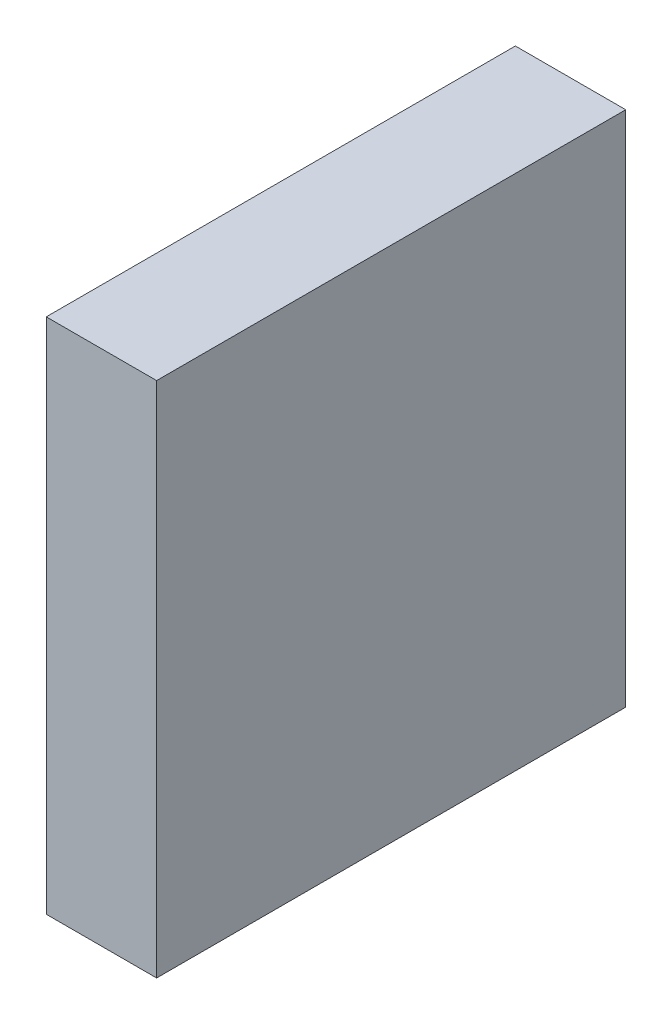
ISO-10303-21;
HEADER;
FILE_DESCRIPTION(('STEP AP214'),'2;1');
FILE_NAME('part.step','',(''),(''),'','','');
FILE_SCHEMA(('AUTOMOTIVE_DESIGN { 1 0 10303 214 1 1 1 1 }'));
ENDSEC;
DATA;
#1=APPLICATION_CONTEXT('core data for automotive mechanical design processes');
#2=APPLICATION_PROTOCOL_DEFINITION('international standard','automotive_design',2000,#1);
#3=PRODUCT_CONTEXT('',#1,'mechanical');
#4=PRODUCT('Part','Part','',(#3));
#5=PRODUCT_RELATED_PRODUCT_CATEGORY('part','',(#4));
#6=PRODUCT_DEFINITION_FORMATION('','',#4);
#7=PRODUCT_DEFINITION_CONTEXT('part definition',#1,'design');
#8=PRODUCT_DEFINITION('design','',#6,#7);
#9=PRODUCT_DEFINITION_SHAPE('','',#8);
#10=(LENGTH_UNIT() NAMED_UNIT(*) SI_UNIT(.MILLI.,.METRE.));
#11=(NAMED_UNIT(*) PLANE_ANGLE_UNIT() SI_UNIT($,.RADIAN.));
#12=(NAMED_UNIT(*) SI_UNIT($,.STERADIAN.) SOLID_ANGLE_UNIT());
#13=UNCERTAINTY_MEASURE_WITH_UNIT(LENGTH_MEASURE(1.E-05),#10,'distance_accuracy_value','');
#14=(GEOMETRIC_REPRESENTATION_CONTEXT(3) GLOBAL_UNCERTAINTY_ASSIGNED_CONTEXT((#13)) GLOBAL_UNIT_ASSIGNED_CONTEXT((#10,
#11,#12)) REPRESENTATION_CONTEXT('',''));
#15=CARTESIAN_POINT('',(0.,0.,0.));
#16=DIRECTION('',(0.,0.,1.));
#17=DIRECTION('',(1.,0.,0.));
#18=AXIS2_PLACEMENT_3D('',#15,#16,#17);
#19=CARTESIAN_POINT('',(7.99999999999999,37.5,68.));
#20=DIRECTION('',(-1.,0.,0.));
#21=DIRECTION('',(0.,-1.,0.));
#22=AXIS2_PLACEMENT_3D('',#19,#20,#21);
#23=PLANE('',#22);
#24=DIRECTION('',(0.,1.,0.));
#25=VECTOR('',#24,1.);
#26=CARTESIAN_POINT('',(7.99999999999999,37.5,0.));
#27=LINE('',#26,#25);
#28=CARTESIAN_POINT('',(8.,-37.5,0.));
#29=VERTEX_POINT('',#28);
#30=CARTESIAN_POINT('',(7.99999999999999,37.5,0.));
#31=VERTEX_POINT('',#30);
#32=EDGE_CURVE('E97',#29,#31,#27,.T.);
#33=ORIENTED_EDGE('',*,*,#32,.T.);
#34=DIRECTION('',(0.,0.,-1.));
#35=VECTOR('',#34,1.);
#36=CARTESIAN_POINT('',(7.99999999999999,37.5,68.));
#37=LINE('',#36,#35);
#38=CARTESIAN_POINT('',(7.99999999999999,37.5,68.));
#39=VERTEX_POINT('',#38);
#40=EDGE_CURVE('E11',#39,#31,#37,.T.);
#41=ORIENTED_EDGE('',*,*,#40,.F.);
#42=DIRECTION('',(0.,1.,0.));
#43=VECTOR('',#42,1.);
#44=CARTESIAN_POINT('',(7.99999999999999,37.5,68.));
#45=LINE('',#44,#43);
#46=CARTESIAN_POINT('',(8.,-37.5,68.));
#47=VERTEX_POINT('',#46);
#48=EDGE_CURVE('E85',#47,#39,#45,.T.);
#49=ORIENTED_EDGE('',*,*,#48,.F.);
#50=DIRECTION('',(0.,0.,-1.));
#51=VECTOR('',#50,1.);
#52=CARTESIAN_POINT('',(8.,-37.5,68.));
#53=LINE('',#52,#51);
#54=EDGE_CURVE('E93',#47,#29,#53,.T.);
#55=ORIENTED_EDGE('',*,*,#54,.T.);
#56=EDGE_LOOP('',(#33,#41,#49,#55));
#57=FACE_BOUND('',#56,.T.);
#58=ADVANCED_FACE('F34',(#57),#23,.F.);
#59=CARTESIAN_POINT('',(-8.00000000000001,37.5,68.));
#60=DIRECTION('',(0.,-1.,0.));
#61=DIRECTION('',(0.,0.,-1.));
#62=AXIS2_PLACEMENT_3D('',#59,#60,#61);
#63=PLANE('',#62);
#64=DIRECTION('',(-1.,0.,0.));
#65=VECTOR('',#64,1.);
#66=CARTESIAN_POINT('',(-8.00000000000001,37.5,0.));
#67=LINE('',#66,#65);
#68=CARTESIAN_POINT('',(-8.00000000000001,37.5,0.));
#69=VERTEX_POINT('',#68);
#70=EDGE_CURVE('E89',#31,#69,#67,.T.);
#71=ORIENTED_EDGE('',*,*,#70,.T.);
#72=DIRECTION('',(0.,0.,-1.));
#73=VECTOR('',#72,1.);
#74=CARTESIAN_POINT('',(-8.00000000000001,37.5,68.));
#75=LINE('',#74,#73);
#76=CARTESIAN_POINT('',(-8.00000000000001,37.5,68.));
#77=VERTEX_POINT('',#76);
#78=EDGE_CURVE('E42',#77,#69,#75,.T.);
#79=ORIENTED_EDGE('',*,*,#78,.F.);
#80=DIRECTION('',(-1.,0.,0.));
#81=VECTOR('',#80,1.);
#82=CARTESIAN_POINT('',(-8.00000000000001,37.5,68.));
#83=LINE('',#82,#81);
#84=EDGE_CURVE('E80',#39,#77,#83,.T.);
#85=ORIENTED_EDGE('',*,*,#84,.F.);
#86=ORIENTED_EDGE('',*,*,#40,.T.);
#87=EDGE_LOOP('',(#71,#79,#85,#86));
#88=FACE_BOUND('',#87,.T.);
#89=ADVANCED_FACE('F88',(#88),#63,.F.);
#90=CARTESIAN_POINT('',(-8.00000000000001,37.5,68.));
#91=DIRECTION('',(1.,0.,0.));
#92=DIRECTION('',(0.,1.,0.));
#93=AXIS2_PLACEMENT_3D('',#90,#91,#92);
#94=PLANE('',#93);
#95=DIRECTION('',(0.,-1.,0.));
#96=VECTOR('',#95,1.);
#97=CARTESIAN_POINT('',(-8.00000000000001,37.5,0.));
#98=LINE('',#97,#96);
#99=CARTESIAN_POINT('',(-8.,-37.5,0.));
#100=VERTEX_POINT('',#99);
#101=EDGE_CURVE('E67',#69,#100,#98,.T.);
#102=ORIENTED_EDGE('',*,*,#101,.T.);
#103=DIRECTION('',(0.,0.,-1.));
#104=VECTOR('',#103,1.);
#105=CARTESIAN_POINT('',(-8.,-37.5,68.));
#106=LINE('',#105,#104);
#107=CARTESIAN_POINT('',(-8.,-37.5,68.));
#108=VERTEX_POINT('',#107);
#109=EDGE_CURVE('E90',#108,#100,#106,.T.);
#110=ORIENTED_EDGE('',*,*,#109,.F.);
#111=DIRECTION('',(0.,-1.,0.));
#112=VECTOR('',#111,1.);
#113=CARTESIAN_POINT('',(-8.00000000000001,37.5,68.));
#114=LINE('',#113,#112);
#115=EDGE_CURVE('E83',#77,#108,#114,.T.);
#116=ORIENTED_EDGE('',*,*,#115,.F.);
#117=ORIENTED_EDGE('',*,*,#78,.T.);
#118=EDGE_LOOP('',(#102,#110,#116,#117));
#119=FACE_BOUND('',#118,.T.);
#120=ADVANCED_FACE('F91',(#119),#94,.F.);
#121=CARTESIAN_POINT('',(-8.,-37.5,68.));
#122=DIRECTION('',(0.,1.,0.));
#123=DIRECTION('',(0.,0.,1.));
#124=AXIS2_PLACEMENT_3D('',#121,#122,#123);
#125=PLANE('',#124);
#126=DIRECTION('',(1.,0.,0.));
#127=VECTOR('',#126,1.);
#128=CARTESIAN_POINT('',(-8.,-37.5,0.));
#129=LINE('',#128,#127);
#130=EDGE_CURVE('E73',#100,#29,#129,.T.);
#131=ORIENTED_EDGE('',*,*,#130,.T.);
#132=ORIENTED_EDGE('',*,*,#54,.F.);
#133=DIRECTION('',(1.,0.,0.));
#134=VECTOR('',#133,1.);
#135=CARTESIAN_POINT('',(-8.,-37.5,68.));
#136=LINE('',#135,#134);
#137=EDGE_CURVE('E50',#108,#47,#136,.T.);
#138=ORIENTED_EDGE('',*,*,#137,.F.);
#139=ORIENTED_EDGE('',*,*,#109,.T.);
#140=EDGE_LOOP('',(#131,#132,#138,#139));
#141=FACE_BOUND('',#140,.T.);
#142=ADVANCED_FACE('F104',(#141),#125,.F.);
#143=CARTESIAN_POINT('',(0.,0.,68.));
#144=DIRECTION('',(0.,0.,1.));
#145=DIRECTION('',(1.,0.,0.));
#146=AXIS2_PLACEMENT_3D('',#143,#144,#145);
#147=PLANE('',#146);
#148=ORIENTED_EDGE('',*,*,#48,.T.);
#149=ORIENTED_EDGE('',*,*,#84,.T.);
#150=ORIENTED_EDGE('',*,*,#115,.T.);
#151=ORIENTED_EDGE('',*,*,#137,.T.);
#152=EDGE_LOOP('',(#148,#149,#150,#151));
#153=FACE_BOUND('',#152,.T.);
#154=ADVANCED_FACE('F81',(#153),#147,.T.);
#155=CARTESIAN_POINT('',(0.,0.,0.));
#156=DIRECTION('',(0.,0.,1.));
#157=DIRECTION('',(1.,0.,0.));
#158=AXIS2_PLACEMENT_3D('',#155,#156,#157);
#159=PLANE('',#158);
#160=ORIENTED_EDGE('',*,*,#32,.F.);
#161=ORIENTED_EDGE('',*,*,#130,.F.);
#162=ORIENTED_EDGE('',*,*,#101,.F.);
#163=ORIENTED_EDGE('',*,*,#70,.F.);
#164=EDGE_LOOP('',(#160,#161,#162,#163));
#165=FACE_BOUND('',#164,.T.);
#166=ADVANCED_FACE('F107',(#165),#159,.F.);
#167=CLOSED_SHELL('',(#58,#89,#120,#142,#154,#166));
#168=MANIFOLD_SOLID_BREP('B2',#167);
#169=ADVANCED_BREP_SHAPE_REPRESENTATION('',(#18,#168),#14);
#170=SHAPE_DEFINITION_REPRESENTATION(#9,#169);
ENDSEC;
END-ISO-10303-21;
